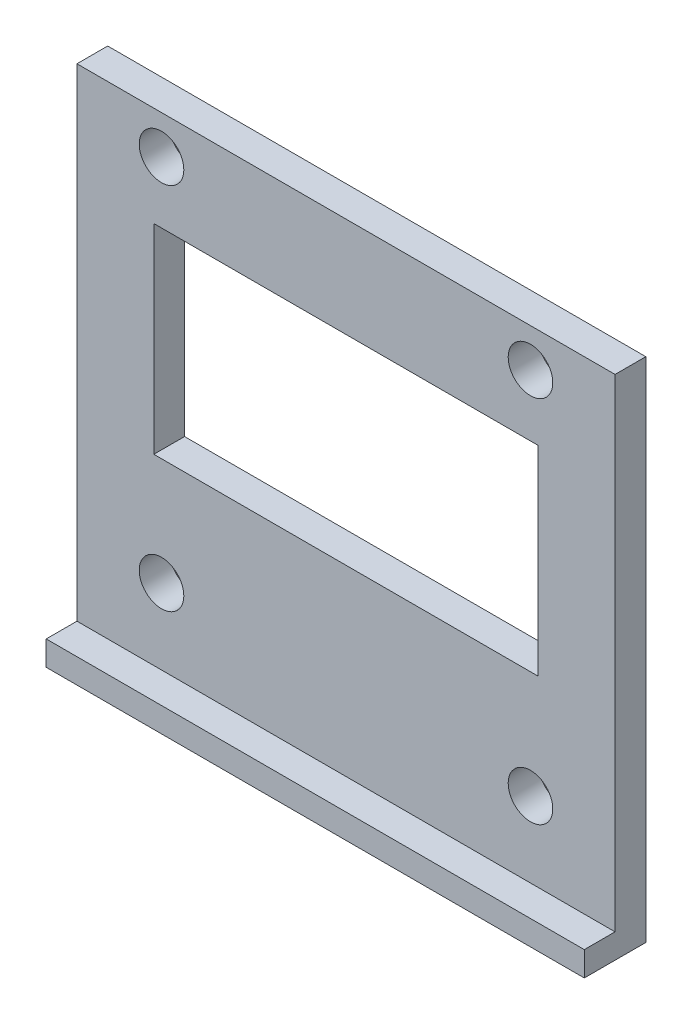
ISO-10303-21;
HEADER;
FILE_DESCRIPTION(('STEP AP214'),'2;1');
FILE_NAME('part.step','',(''),(''),'','','');
FILE_SCHEMA(('AUTOMOTIVE_DESIGN { 1 0 10303 214 1 1 1 1 }'));
ENDSEC;
DATA;
#1=APPLICATION_CONTEXT('core data for automotive mechanical design processes');
#2=APPLICATION_PROTOCOL_DEFINITION('international standard','automotive_design',2000,#1);
#3=PRODUCT_CONTEXT('',#1,'mechanical');
#4=PRODUCT('Part','Part','',(#3));
#5=PRODUCT_RELATED_PRODUCT_CATEGORY('part','',(#4));
#6=PRODUCT_DEFINITION_FORMATION('','',#4);
#7=PRODUCT_DEFINITION_CONTEXT('part definition',#1,'design');
#8=PRODUCT_DEFINITION('design','',#6,#7);
#9=PRODUCT_DEFINITION_SHAPE('','',#8);
#10=(LENGTH_UNIT() NAMED_UNIT(*) SI_UNIT(.MILLI.,.METRE.));
#11=(NAMED_UNIT(*) PLANE_ANGLE_UNIT() SI_UNIT($,.RADIAN.));
#12=(NAMED_UNIT(*) SI_UNIT($,.STERADIAN.) SOLID_ANGLE_UNIT());
#13=UNCERTAINTY_MEASURE_WITH_UNIT(LENGTH_MEASURE(1.E-05),#10,'distance_accuracy_value','');
#14=(GEOMETRIC_REPRESENTATION_CONTEXT(3) GLOBAL_UNCERTAINTY_ASSIGNED_CONTEXT((#13)) GLOBAL_UNIT_ASSIGNED_CONTEXT((#10,
#11,#12)) REPRESENTATION_CONTEXT('',''));
#15=CARTESIAN_POINT('',(0.,0.,0.));
#16=DIRECTION('',(0.,0.,1.));
#17=DIRECTION('',(1.,0.,0.));
#18=AXIS2_PLACEMENT_3D('',#15,#16,#17);
#19=CARTESIAN_POINT('',(0.,0.,2.));
#20=DIRECTION('',(0.,0.,-1.));
#21=DIRECTION('',(-1.,0.,0.));
#22=AXIS2_PLACEMENT_3D('',#19,#20,#21);
#23=PLANE('',#22);
#24=CARTESIAN_POINT('',(12.,10.5000000000001,2.));
#25=DIRECTION('',(0.,0.,1.));
#26=DIRECTION('',(-1.,0.,0.));
#27=AXIS2_PLACEMENT_3D('',#24,#25,#26);
#28=CIRCLE('',#27,1.45);
#29=CARTESIAN_POINT('',(10.55,10.5000000000001,2.));
#30=VERTEX_POINT('',#29);
#31=EDGE_CURVE('E168',#30,#30,#28,.T.);
#32=ORIENTED_EDGE('',*,*,#31,.F.);
#33=EDGE_LOOP('',(#32));
#34=FACE_BOUND('',#33,.T.);
#35=CARTESIAN_POINT('',(12.,-13.5,2.));
#36=DIRECTION('',(0.,0.,1.));
#37=DIRECTION('',(-1.,0.,0.));
#38=AXIS2_PLACEMENT_3D('',#35,#36,#37);
#39=CIRCLE('',#38,1.45);
#40=CARTESIAN_POINT('',(10.55,-13.5,2.));
#41=VERTEX_POINT('',#40);
#42=EDGE_CURVE('E182',#41,#41,#39,.T.);
#43=ORIENTED_EDGE('',*,*,#42,.F.);
#44=EDGE_LOOP('',(#43));
#45=FACE_BOUND('',#44,.T.);
#46=CARTESIAN_POINT('',(-12.,-13.5,2.));
#47=DIRECTION('',(0.,0.,1.));
#48=DIRECTION('',(1.,0.,0.));
#49=AXIS2_PLACEMENT_3D('',#46,#47,#48);
#50=CIRCLE('',#49,1.45);
#51=CARTESIAN_POINT('',(-10.55,-13.5,2.));
#52=VERTEX_POINT('',#51);
#53=EDGE_CURVE('E176',#52,#52,#50,.T.);
#54=ORIENTED_EDGE('',*,*,#53,.F.);
#55=EDGE_LOOP('',(#54));
#56=FACE_BOUND('',#55,.T.);
#57=CARTESIAN_POINT('',(-12.,10.5,2.));
#58=DIRECTION('',(0.,0.,1.));
#59=DIRECTION('',(1.,0.,0.));
#60=AXIS2_PLACEMENT_3D('',#57,#58,#59);
#61=CIRCLE('',#60,1.45);
#62=CARTESIAN_POINT('',(-10.55,10.5,2.));
#63=VERTEX_POINT('',#62);
#64=EDGE_CURVE('E175',#63,#63,#61,.T.);
#65=ORIENTED_EDGE('',*,*,#64,.F.);
#66=EDGE_LOOP('',(#65));
#67=FACE_BOUND('',#66,.T.);
#68=DIRECTION('',(1.,0.,0.));
#69=VECTOR('',#68,1.);
#70=CARTESIAN_POINT('',(-14.5,13.,2.));
#71=LINE('',#70,#69);
#72=CARTESIAN_POINT('',(-17.5,13.,2.));
#73=VERTEX_POINT('',#72);
#74=CARTESIAN_POINT('',(17.5,13.,2.));
#75=VERTEX_POINT('',#74);
#76=EDGE_CURVE('E163',#73,#75,#71,.T.);
#77=ORIENTED_EDGE('',*,*,#76,.F.);
#78=DIRECTION('',(0.,1.,0.));
#79=VECTOR('',#78,1.);
#80=CARTESIAN_POINT('',(-17.5,0.,2.));
#81=LINE('',#80,#79);
#82=CARTESIAN_POINT('',(-17.4999999999999,-18.4,2.));
#83=VERTEX_POINT('',#82);
#84=EDGE_CURVE('E119',#83,#73,#81,.T.);
#85=ORIENTED_EDGE('',*,*,#84,.F.);
#86=DIRECTION('',(1.,0.,0.));
#87=VECTOR('',#86,1.);
#88=CARTESIAN_POINT('',(-14.5,-18.4,2.));
#89=LINE('',#88,#87);
#90=CARTESIAN_POINT('',(17.5,-18.4,2.));
#91=VERTEX_POINT('',#90);
#92=EDGE_CURVE('E113',#83,#91,#89,.T.);
#93=ORIENTED_EDGE('',*,*,#92,.T.);
#94=DIRECTION('',(0.,1.,0.));
#95=VECTOR('',#94,1.);
#96=CARTESIAN_POINT('',(17.5,0.,2.));
#97=LINE('',#96,#95);
#98=EDGE_CURVE('E117',#91,#75,#97,.T.);
#99=ORIENTED_EDGE('',*,*,#98,.T.);
#100=EDGE_LOOP('',(#77,#85,#93,#99));
#101=FACE_BOUND('',#100,.T.);
#102=DIRECTION('',(0.,1.,0.));
#103=VECTOR('',#102,1.);
#104=CARTESIAN_POINT('',(12.5,-6.5,2.));
#105=LINE('',#104,#103);
#106=CARTESIAN_POINT('',(12.5,-6.5,2.));
#107=VERTEX_POINT('',#106);
#108=CARTESIAN_POINT('',(12.5,6.5,2.));
#109=VERTEX_POINT('',#108);
#110=EDGE_CURVE('E195',#107,#109,#105,.T.);
#111=ORIENTED_EDGE('',*,*,#110,.F.);
#112=DIRECTION('',(1.,0.,0.));
#113=VECTOR('',#112,1.);
#114=CARTESIAN_POINT('',(-12.5,-6.5,2.));
#115=LINE('',#114,#113);
#116=CARTESIAN_POINT('',(-12.5,-6.5,2.));
#117=VERTEX_POINT('',#116);
#118=EDGE_CURVE('E202',#117,#107,#115,.T.);
#119=ORIENTED_EDGE('',*,*,#118,.F.);
#120=DIRECTION('',(0.,-1.,0.));
#121=VECTOR('',#120,1.);
#122=CARTESIAN_POINT('',(-12.5,-6.5,2.));
#123=LINE('',#122,#121);
#124=CARTESIAN_POINT('',(-12.5,6.5,2.));
#125=VERTEX_POINT('',#124);
#126=EDGE_CURVE('E200',#125,#117,#123,.T.);
#127=ORIENTED_EDGE('',*,*,#126,.F.);
#128=DIRECTION('',(-1.,0.,0.));
#129=VECTOR('',#128,1.);
#130=CARTESIAN_POINT('',(-12.5,6.5,2.));
#131=LINE('',#130,#129);
#132=EDGE_CURVE('E197',#109,#125,#131,.T.);
#133=ORIENTED_EDGE('',*,*,#132,.F.);
#134=EDGE_LOOP('',(#111,#119,#127,#133));
#135=FACE_BOUND('',#134,.T.);
#136=ADVANCED_FACE('F35',(#34,#45,#56,#67,#101,#135),#23,.F.);
#137=CARTESIAN_POINT('',(0.,0.,0.));
#138=DIRECTION('',(0.,0.,-1.));
#139=DIRECTION('',(-1.,0.,0.));
#140=AXIS2_PLACEMENT_3D('',#137,#138,#139);
#141=PLANE('',#140);
#142=CARTESIAN_POINT('',(12.,10.5000000000001,0.));
#143=DIRECTION('',(0.,0.,1.));
#144=DIRECTION('',(-1.,0.,0.));
#145=AXIS2_PLACEMENT_3D('',#142,#143,#144);
#146=CIRCLE('',#145,1.45);
#147=CARTESIAN_POINT('',(10.55,10.5000000000001,0.));
#148=VERTEX_POINT('',#147);
#149=EDGE_CURVE('E185',#148,#148,#146,.T.);
#150=ORIENTED_EDGE('',*,*,#149,.T.);
#151=EDGE_LOOP('',(#150));
#152=FACE_BOUND('',#151,.T.);
#153=CARTESIAN_POINT('',(12.,-13.5,0.));
#154=DIRECTION('',(0.,0.,1.));
#155=DIRECTION('',(-1.,0.,0.));
#156=AXIS2_PLACEMENT_3D('',#153,#154,#155);
#157=CIRCLE('',#156,1.45);
#158=CARTESIAN_POINT('',(10.55,-13.5,0.));
#159=VERTEX_POINT('',#158);
#160=EDGE_CURVE('E179',#159,#159,#157,.T.);
#161=ORIENTED_EDGE('',*,*,#160,.T.);
#162=EDGE_LOOP('',(#161));
#163=FACE_BOUND('',#162,.T.);
#164=CARTESIAN_POINT('',(-12.,-13.5,0.));
#165=DIRECTION('',(0.,0.,1.));
#166=DIRECTION('',(1.,0.,0.));
#167=AXIS2_PLACEMENT_3D('',#164,#165,#166);
#168=CIRCLE('',#167,1.45);
#169=CARTESIAN_POINT('',(-10.55,-13.5,0.));
#170=VERTEX_POINT('',#169);
#171=EDGE_CURVE('E172',#170,#170,#168,.T.);
#172=ORIENTED_EDGE('',*,*,#171,.T.);
#173=EDGE_LOOP('',(#172));
#174=FACE_BOUND('',#173,.T.);
#175=CARTESIAN_POINT('',(-12.,10.5,0.));
#176=DIRECTION('',(0.,0.,1.));
#177=DIRECTION('',(1.,0.,0.));
#178=AXIS2_PLACEMENT_3D('',#175,#176,#177);
#179=CIRCLE('',#178,1.45);
#180=CARTESIAN_POINT('',(-10.55,10.5,0.));
#181=VERTEX_POINT('',#180);
#182=EDGE_CURVE('E190',#181,#181,#179,.T.);
#183=ORIENTED_EDGE('',*,*,#182,.T.);
#184=EDGE_LOOP('',(#183));
#185=FACE_BOUND('',#184,.T.);
#186=DIRECTION('',(1.,0.,0.));
#187=VECTOR('',#186,1.);
#188=CARTESIAN_POINT('',(-14.5,-20.,0.));
#189=LINE('',#188,#187);
#190=CARTESIAN_POINT('',(-17.4999999999999,-20.,0.));
#191=VERTEX_POINT('',#190);
#192=CARTESIAN_POINT('',(17.5,-20.,0.));
#193=VERTEX_POINT('',#192);
#194=EDGE_CURVE('E166',#191,#193,#189,.T.);
#195=ORIENTED_EDGE('',*,*,#194,.F.);
#196=DIRECTION('',(0.,1.,0.));
#197=VECTOR('',#196,1.);
#198=CARTESIAN_POINT('',(-17.5,0.,0.));
#199=LINE('',#198,#197);
#200=CARTESIAN_POINT('',(-17.5,13.,0.));
#201=VERTEX_POINT('',#200);
#202=EDGE_CURVE('E160',#191,#201,#199,.T.);
#203=ORIENTED_EDGE('',*,*,#202,.T.);
#204=DIRECTION('',(-1.,0.,0.));
#205=VECTOR('',#204,1.);
#206=CARTESIAN_POINT('',(-14.5,13.,0.));
#207=LINE('',#206,#205);
#208=CARTESIAN_POINT('',(17.5,13.,0.));
#209=VERTEX_POINT('',#208);
#210=EDGE_CURVE('E124',#209,#201,#207,.T.);
#211=ORIENTED_EDGE('',*,*,#210,.F.);
#212=DIRECTION('',(0.,1.,0.));
#213=VECTOR('',#212,1.);
#214=CARTESIAN_POINT('',(17.5,0.,0.));
#215=LINE('',#214,#213);
#216=EDGE_CURVE('E145',#193,#209,#215,.T.);
#217=ORIENTED_EDGE('',*,*,#216,.F.);
#218=EDGE_LOOP('',(#195,#203,#211,#217));
#219=FACE_BOUND('',#218,.T.);
#220=DIRECTION('',(1.,0.,0.));
#221=VECTOR('',#220,1.);
#222=CARTESIAN_POINT('',(-12.5,-6.5,0.));
#223=LINE('',#222,#221);
#224=CARTESIAN_POINT('',(-12.5,-6.5,0.));
#225=VERTEX_POINT('',#224);
#226=CARTESIAN_POINT('',(12.5,-6.5,0.));
#227=VERTEX_POINT('',#226);
#228=EDGE_CURVE('E198',#225,#227,#223,.T.);
#229=ORIENTED_EDGE('',*,*,#228,.T.);
#230=DIRECTION('',(0.,1.,0.));
#231=VECTOR('',#230,1.);
#232=CARTESIAN_POINT('',(12.5,-6.5,0.));
#233=LINE('',#232,#231);
#234=CARTESIAN_POINT('',(12.5,6.5,0.));
#235=VERTEX_POINT('',#234);
#236=EDGE_CURVE('E57',#227,#235,#233,.T.);
#237=ORIENTED_EDGE('',*,*,#236,.T.);
#238=DIRECTION('',(-1.,0.,0.));
#239=VECTOR('',#238,1.);
#240=CARTESIAN_POINT('',(-12.5,6.5,0.));
#241=LINE('',#240,#239);
#242=CARTESIAN_POINT('',(-12.5,6.5,0.));
#243=VERTEX_POINT('',#242);
#244=EDGE_CURVE('E206',#235,#243,#241,.T.);
#245=ORIENTED_EDGE('',*,*,#244,.T.);
#246=DIRECTION('',(0.,-1.,0.));
#247=VECTOR('',#246,1.);
#248=CARTESIAN_POINT('',(-12.5,-6.5,0.));
#249=LINE('',#248,#247);
#250=EDGE_CURVE('E209',#243,#225,#249,.T.);
#251=ORIENTED_EDGE('',*,*,#250,.T.);
#252=EDGE_LOOP('',(#229,#237,#245,#251));
#253=FACE_BOUND('',#252,.T.);
#254=ADVANCED_FACE('F37',(#152,#163,#174,#185,#219,#253),#141,.T.);
#255=CARTESIAN_POINT('',(12.5,-6.5,2.));
#256=DIRECTION('',(-1.,0.,0.));
#257=DIRECTION('',(0.,0.,1.));
#258=AXIS2_PLACEMENT_3D('',#255,#256,#257);
#259=PLANE('',#258);
#260=ORIENTED_EDGE('',*,*,#236,.F.);
#261=DIRECTION('',(0.,0.,-1.));
#262=VECTOR('',#261,1.);
#263=CARTESIAN_POINT('',(12.5,-6.5,2.));
#264=LINE('',#263,#262);
#265=EDGE_CURVE('E204',#107,#227,#264,.T.);
#266=ORIENTED_EDGE('',*,*,#265,.F.);
#267=ORIENTED_EDGE('',*,*,#110,.T.);
#268=DIRECTION('',(0.,0.,-1.));
#269=VECTOR('',#268,1.);
#270=CARTESIAN_POINT('',(12.5,6.5,2.));
#271=LINE('',#270,#269);
#272=EDGE_CURVE('E11',#109,#235,#271,.T.);
#273=ORIENTED_EDGE('',*,*,#272,.T.);
#274=EDGE_LOOP('',(#260,#266,#267,#273));
#275=FACE_BOUND('',#274,.T.);
#276=ADVANCED_FACE('F228',(#275),#259,.T.);
#277=CARTESIAN_POINT('',(-12.5,6.5,2.));
#278=DIRECTION('',(0.,-1.,0.));
#279=DIRECTION('',(0.,0.,-1.));
#280=AXIS2_PLACEMENT_3D('',#277,#278,#279);
#281=PLANE('',#280);
#282=ORIENTED_EDGE('',*,*,#244,.F.);
#283=ORIENTED_EDGE('',*,*,#272,.F.);
#284=ORIENTED_EDGE('',*,*,#132,.T.);
#285=DIRECTION('',(0.,0.,-1.));
#286=VECTOR('',#285,1.);
#287=CARTESIAN_POINT('',(-12.5,6.5,2.));
#288=LINE('',#287,#286);
#289=EDGE_CURVE('E43',#125,#243,#288,.T.);
#290=ORIENTED_EDGE('',*,*,#289,.T.);
#291=EDGE_LOOP('',(#282,#283,#284,#290));
#292=FACE_BOUND('',#291,.T.);
#293=ADVANCED_FACE('F218',(#292),#281,.T.);
#294=CARTESIAN_POINT('',(-12.5,-6.5,2.));
#295=DIRECTION('',(1.,0.,0.));
#296=DIRECTION('',(0.,0.,-1.));
#297=AXIS2_PLACEMENT_3D('',#294,#295,#296);
#298=PLANE('',#297);
#299=ORIENTED_EDGE('',*,*,#250,.F.);
#300=ORIENTED_EDGE('',*,*,#289,.F.);
#301=ORIENTED_EDGE('',*,*,#126,.T.);
#302=DIRECTION('',(0.,0.,-1.));
#303=VECTOR('',#302,1.);
#304=CARTESIAN_POINT('',(-12.5,-6.5,2.));
#305=LINE('',#304,#303);
#306=EDGE_CURVE('E50',#117,#225,#305,.T.);
#307=ORIENTED_EDGE('',*,*,#306,.T.);
#308=EDGE_LOOP('',(#299,#300,#301,#307));
#309=FACE_BOUND('',#308,.T.);
#310=ADVANCED_FACE('F223',(#309),#298,.T.);
#311=CARTESIAN_POINT('',(-12.5,-6.5,2.));
#312=DIRECTION('',(0.,1.,0.));
#313=DIRECTION('',(0.,0.,1.));
#314=AXIS2_PLACEMENT_3D('',#311,#312,#313);
#315=PLANE('',#314);
#316=ORIENTED_EDGE('',*,*,#228,.F.);
#317=ORIENTED_EDGE('',*,*,#306,.F.);
#318=ORIENTED_EDGE('',*,*,#118,.T.);
#319=ORIENTED_EDGE('',*,*,#265,.T.);
#320=EDGE_LOOP('',(#316,#317,#318,#319));
#321=FACE_BOUND('',#320,.T.);
#322=ADVANCED_FACE('F225',(#321),#315,.T.);
#323=CARTESIAN_POINT('',(-12.,10.5,0.));
#324=DIRECTION('',(0.,0.,1.));
#325=DIRECTION('',(1.,0.,0.));
#326=AXIS2_PLACEMENT_3D('',#323,#324,#325);
#327=CYLINDRICAL_SURFACE('',#326,1.45);
#328=ORIENTED_EDGE('',*,*,#182,.F.);
#329=EDGE_LOOP('',(#328));
#330=FACE_BOUND('',#329,.T.);
#331=ORIENTED_EDGE('',*,*,#64,.T.);
#332=EDGE_LOOP('',(#331));
#333=FACE_BOUND('',#332,.T.);
#334=ADVANCED_FACE('F246',(#330,#333),#327,.F.);
#335=CARTESIAN_POINT('',(-12.,-13.5,0.));
#336=DIRECTION('',(0.,0.,1.));
#337=DIRECTION('',(1.,0.,0.));
#338=AXIS2_PLACEMENT_3D('',#335,#336,#337);
#339=CYLINDRICAL_SURFACE('',#338,1.45);
#340=ORIENTED_EDGE('',*,*,#171,.F.);
#341=EDGE_LOOP('',(#340));
#342=FACE_BOUND('',#341,.T.);
#343=ORIENTED_EDGE('',*,*,#53,.T.);
#344=EDGE_LOOP('',(#343));
#345=FACE_BOUND('',#344,.T.);
#346=ADVANCED_FACE('F249',(#342,#345),#339,.F.);
#347=CARTESIAN_POINT('',(12.,-13.5,0.));
#348=DIRECTION('',(0.,0.,1.));
#349=DIRECTION('',(1.,0.,0.));
#350=AXIS2_PLACEMENT_3D('',#347,#348,#349);
#351=CYLINDRICAL_SURFACE('',#350,1.45);
#352=ORIENTED_EDGE('',*,*,#160,.F.);
#353=EDGE_LOOP('',(#352));
#354=FACE_BOUND('',#353,.T.);
#355=ORIENTED_EDGE('',*,*,#42,.T.);
#356=EDGE_LOOP('',(#355));
#357=FACE_BOUND('',#356,.T.);
#358=ADVANCED_FACE('F255',(#354,#357),#351,.F.);
#359=CARTESIAN_POINT('',(12.,10.5000000000001,0.));
#360=DIRECTION('',(0.,0.,1.));
#361=DIRECTION('',(1.,0.,0.));
#362=AXIS2_PLACEMENT_3D('',#359,#360,#361);
#363=CYLINDRICAL_SURFACE('',#362,1.45);
#364=ORIENTED_EDGE('',*,*,#149,.F.);
#365=EDGE_LOOP('',(#364));
#366=FACE_BOUND('',#365,.T.);
#367=ORIENTED_EDGE('',*,*,#31,.T.);
#368=EDGE_LOOP('',(#367));
#369=FACE_BOUND('',#368,.T.);
#370=ADVANCED_FACE('F251',(#366,#369),#363,.F.);
#371=CARTESIAN_POINT('',(-14.5,-20.,4.));
#372=DIRECTION('',(0.,-1.,0.));
#373=DIRECTION('',(1.,0.,0.));
#374=AXIS2_PLACEMENT_3D('',#371,#372,#373);
#375=PLANE('',#374);
#376=ORIENTED_EDGE('',*,*,#194,.T.);
#377=DIRECTION('',(0.,0.,1.));
#378=VECTOR('',#377,1.);
#379=CARTESIAN_POINT('',(17.5,-20.,0.));
#380=LINE('',#379,#378);
#381=CARTESIAN_POINT('',(17.5,-20.,4.));
#382=VERTEX_POINT('',#381);
#383=EDGE_CURVE('E142',#193,#382,#380,.T.);
#384=ORIENTED_EDGE('',*,*,#383,.T.);
#385=DIRECTION('',(1.,0.,0.));
#386=VECTOR('',#385,1.);
#387=CARTESIAN_POINT('',(-14.5,-20.,4.));
#388=LINE('',#387,#386);
#389=CARTESIAN_POINT('',(-17.4999999999999,-20.,4.));
#390=VERTEX_POINT('',#389);
#391=EDGE_CURVE('E169',#390,#382,#388,.T.);
#392=ORIENTED_EDGE('',*,*,#391,.F.);
#393=DIRECTION('',(0.,0.,1.));
#394=VECTOR('',#393,1.);
#395=CARTESIAN_POINT('',(-17.4999999999999,-20.,0.));
#396=LINE('',#395,#394);
#397=EDGE_CURVE('E148',#191,#390,#396,.T.);
#398=ORIENTED_EDGE('',*,*,#397,.F.);
#399=EDGE_LOOP('',(#376,#384,#392,#398));
#400=FACE_BOUND('',#399,.T.);
#401=ADVANCED_FACE('F254',(#400),#375,.T.);
#402=CARTESIAN_POINT('',(-14.5,-18.4,4.));
#403=DIRECTION('',(0.,0.,1.));
#404=DIRECTION('',(1.,0.,0.));
#405=AXIS2_PLACEMENT_3D('',#402,#403,#404);
#406=PLANE('',#405);
#407=ORIENTED_EDGE('',*,*,#391,.T.);
#408=DIRECTION('',(0.,1.,0.));
#409=VECTOR('',#408,1.);
#410=CARTESIAN_POINT('',(17.5,0.,4.));
#411=LINE('',#410,#409);
#412=CARTESIAN_POINT('',(17.5,-18.4,4.));
#413=VERTEX_POINT('',#412);
#414=EDGE_CURVE('E132',#382,#413,#411,.T.);
#415=ORIENTED_EDGE('',*,*,#414,.T.);
#416=DIRECTION('',(1.,0.,0.));
#417=VECTOR('',#416,1.);
#418=CARTESIAN_POINT('',(-14.5,-18.4,4.));
#419=LINE('',#418,#417);
#420=CARTESIAN_POINT('',(-17.4999999999999,-18.4,4.));
#421=VERTEX_POINT('',#420);
#422=EDGE_CURVE('E123',#421,#413,#419,.T.);
#423=ORIENTED_EDGE('',*,*,#422,.F.);
#424=DIRECTION('',(0.,-1.,0.));
#425=VECTOR('',#424,1.);
#426=CARTESIAN_POINT('',(-17.5,0.,4.));
#427=LINE('',#426,#425);
#428=EDGE_CURVE('E151',#421,#390,#427,.T.);
#429=ORIENTED_EDGE('',*,*,#428,.T.);
#430=EDGE_LOOP('',(#407,#415,#423,#429));
#431=FACE_BOUND('',#430,.T.);
#432=ADVANCED_FACE('F266',(#431),#406,.T.);
#433=CARTESIAN_POINT('',(-14.5,-18.4,2.));
#434=DIRECTION('',(0.,1.,0.));
#435=DIRECTION('',(-1.,0.,0.));
#436=AXIS2_PLACEMENT_3D('',#433,#434,#435);
#437=PLANE('',#436);
#438=ORIENTED_EDGE('',*,*,#422,.T.);
#439=DIRECTION('',(0.,0.,1.));
#440=VECTOR('',#439,1.);
#441=CARTESIAN_POINT('',(17.5,-18.4,0.));
#442=LINE('',#441,#440);
#443=EDGE_CURVE('E127',#91,#413,#442,.T.);
#444=ORIENTED_EDGE('',*,*,#443,.F.);
#445=ORIENTED_EDGE('',*,*,#92,.F.);
#446=DIRECTION('',(0.,0.,1.));
#447=VECTOR('',#446,1.);
#448=CARTESIAN_POINT('',(-17.4999999999999,-18.4,0.));
#449=LINE('',#448,#447);
#450=EDGE_CURVE('E154',#83,#421,#449,.T.);
#451=ORIENTED_EDGE('',*,*,#450,.T.);
#452=EDGE_LOOP('',(#438,#444,#445,#451));
#453=FACE_BOUND('',#452,.T.);
#454=ADVANCED_FACE('F128',(#453),#437,.T.);
#455=CARTESIAN_POINT('',(0.,13.,0.));
#456=DIRECTION('',(0.,-1.,0.));
#457=DIRECTION('',(1.,0.,0.));
#458=AXIS2_PLACEMENT_3D('',#455,#456,#457);
#459=PLANE('',#458);
#460=ORIENTED_EDGE('',*,*,#210,.T.);
#461=DIRECTION('',(0.,0.,1.));
#462=VECTOR('',#461,1.);
#463=CARTESIAN_POINT('',(-17.5,13.,0.));
#464=LINE('',#463,#462);
#465=EDGE_CURVE('E157',#201,#73,#464,.T.);
#466=ORIENTED_EDGE('',*,*,#465,.T.);
#467=ORIENTED_EDGE('',*,*,#76,.T.);
#468=DIRECTION('',(0.,0.,1.));
#469=VECTOR('',#468,1.);
#470=CARTESIAN_POINT('',(17.5,13.,0.));
#471=LINE('',#470,#469);
#472=EDGE_CURVE('E138',#209,#75,#471,.T.);
#473=ORIENTED_EDGE('',*,*,#472,.F.);
#474=EDGE_LOOP('',(#460,#466,#467,#473));
#475=FACE_BOUND('',#474,.T.);
#476=ADVANCED_FACE('F265',(#475),#459,.F.);
#477=CARTESIAN_POINT('',(-17.5,0.,0.));
#478=DIRECTION('',(-1.,0.,0.));
#479=DIRECTION('',(0.,-1.,0.));
#480=AXIS2_PLACEMENT_3D('',#477,#478,#479);
#481=PLANE('',#480);
#482=ORIENTED_EDGE('',*,*,#397,.T.);
#483=ORIENTED_EDGE('',*,*,#428,.F.);
#484=ORIENTED_EDGE('',*,*,#450,.F.);
#485=ORIENTED_EDGE('',*,*,#84,.T.);
#486=ORIENTED_EDGE('',*,*,#465,.F.);
#487=ORIENTED_EDGE('',*,*,#202,.F.);
#488=EDGE_LOOP('',(#482,#483,#484,#485,#486,#487));
#489=FACE_BOUND('',#488,.T.);
#490=ADVANCED_FACE('F275',(#489),#481,.T.);
#491=CARTESIAN_POINT('',(17.5,0.,0.));
#492=DIRECTION('',(1.,0.,0.));
#493=DIRECTION('',(0.,1.,0.));
#494=AXIS2_PLACEMENT_3D('',#491,#492,#493);
#495=PLANE('',#494);
#496=ORIENTED_EDGE('',*,*,#98,.F.);
#497=ORIENTED_EDGE('',*,*,#443,.T.);
#498=ORIENTED_EDGE('',*,*,#414,.F.);
#499=ORIENTED_EDGE('',*,*,#383,.F.);
#500=ORIENTED_EDGE('',*,*,#216,.T.);
#501=ORIENTED_EDGE('',*,*,#472,.T.);
#502=EDGE_LOOP('',(#496,#497,#498,#499,#500,#501));
#503=FACE_BOUND('',#502,.T.);
#504=ADVANCED_FACE('F135',(#503),#495,.T.);
#505=CLOSED_SHELL('',(#136,#254,#276,#293,#310,#322,#334,#346,#358,#370,#401,#432,#454,#476,
#490,#504));
#506=MANIFOLD_SOLID_BREP('B2',#505);
#507=ADVANCED_BREP_SHAPE_REPRESENTATION('',(#18,#506),#14);
#508=SHAPE_DEFINITION_REPRESENTATION(#9,#507);
ENDSEC;
END-ISO-10303-21;
